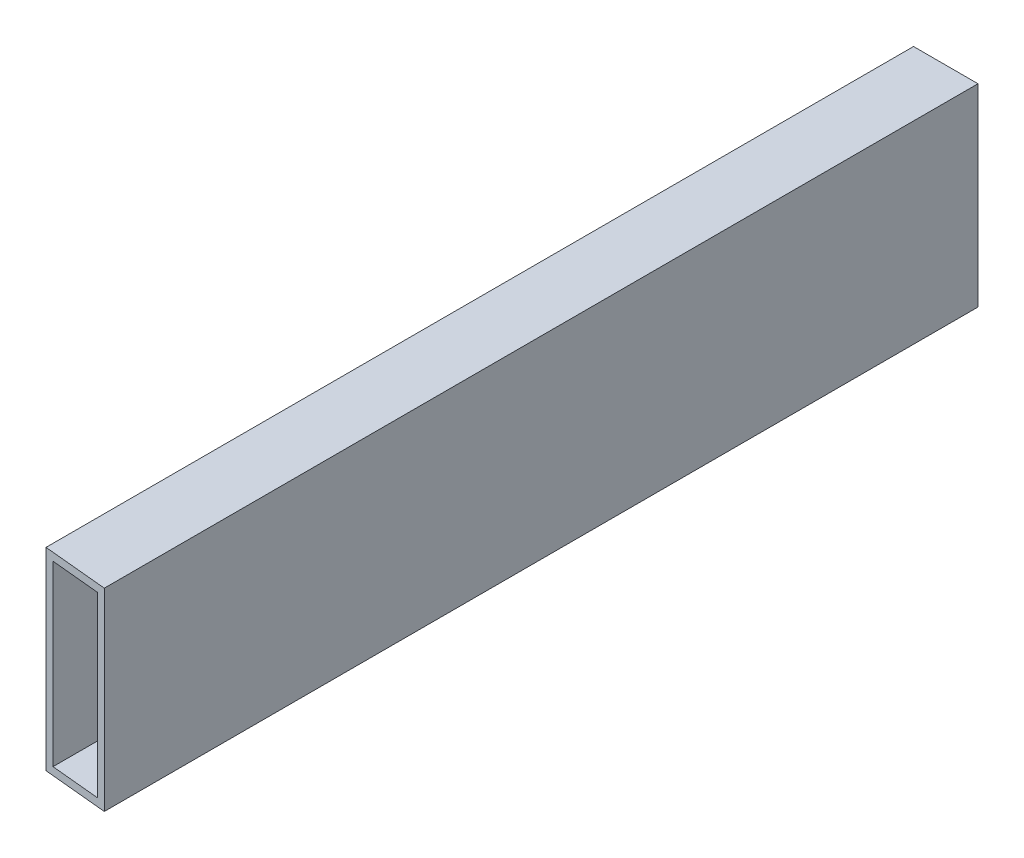
ISO-10303-21;
HEADER;
FILE_DESCRIPTION(('STEP AP214'),'2;1');
FILE_NAME('part.step','',(''),(''),'','','');
FILE_SCHEMA(('AUTOMOTIVE_DESIGN { 1 0 10303 214 1 1 1 1 }'));
ENDSEC;
DATA;
#1=APPLICATION_CONTEXT('core data for automotive mechanical design processes');
#2=APPLICATION_PROTOCOL_DEFINITION('international standard','automotive_design',2000,#1);
#3=PRODUCT_CONTEXT('',#1,'mechanical');
#4=PRODUCT('Part','Part','',(#3));
#5=PRODUCT_RELATED_PRODUCT_CATEGORY('part','',(#4));
#6=PRODUCT_DEFINITION_FORMATION('','',#4);
#7=PRODUCT_DEFINITION_CONTEXT('part definition',#1,'design');
#8=PRODUCT_DEFINITION('design','',#6,#7);
#9=PRODUCT_DEFINITION_SHAPE('','',#8);
#10=(LENGTH_UNIT() NAMED_UNIT(*) SI_UNIT(.MILLI.,.METRE.));
#11=(NAMED_UNIT(*) PLANE_ANGLE_UNIT() SI_UNIT($,.RADIAN.));
#12=(NAMED_UNIT(*) SI_UNIT($,.STERADIAN.) SOLID_ANGLE_UNIT());
#13=UNCERTAINTY_MEASURE_WITH_UNIT(LENGTH_MEASURE(1.E-05),#10,'distance_accuracy_value','');
#14=(GEOMETRIC_REPRESENTATION_CONTEXT(3) GLOBAL_UNCERTAINTY_ASSIGNED_CONTEXT((#13)) GLOBAL_UNIT_ASSIGNED_CONTEXT((#10,
#11,#12)) REPRESENTATION_CONTEXT('',''));
#15=CARTESIAN_POINT('',(0.,0.,0.));
#16=DIRECTION('',(0.,0.,1.));
#17=DIRECTION('',(1.,0.,0.));
#18=AXIS2_PLACEMENT_3D('',#15,#16,#17);
#19=CARTESIAN_POINT('',(12.7000000000001,0.,343.));
#20=DIRECTION('',(-1.,0.,0.));
#21=DIRECTION('',(0.,-1.,0.));
#22=AXIS2_PLACEMENT_3D('',#19,#20,#21);
#23=PLANE('',#22);
#24=DIRECTION('',(0.,0.,-1.));
#25=VECTOR('',#24,1.);
#26=CARTESIAN_POINT('',(12.7,38.1,343.));
#27=LINE('',#26,#25);
#28=CARTESIAN_POINT('',(12.7,38.1,344.217788135193));
#29=VERTEX_POINT('',#28);
#30=CARTESIAN_POINT('',(12.7,38.1,0.));
#31=VERTEX_POINT('',#30);
#32=EDGE_CURVE('E11',#29,#31,#27,.T.);
#33=ORIENTED_EDGE('',*,*,#32,.F.);
#34=DIRECTION('',(0.,-1.,0.));
#35=VECTOR('',#34,1.);
#36=CARTESIAN_POINT('',(12.7000000000001,0.,344.217788135193));
#37=LINE('',#36,#35);
#38=CARTESIAN_POINT('',(12.7,-38.1,344.217788135193));
#39=VERTEX_POINT('',#38);
#40=EDGE_CURVE('E100',#29,#39,#37,.T.);
#41=ORIENTED_EDGE('',*,*,#40,.T.);
#42=DIRECTION('',(0.,0.,-1.));
#43=VECTOR('',#42,1.);
#44=CARTESIAN_POINT('',(12.7,-38.1,343.));
#45=LINE('',#44,#43);
#46=CARTESIAN_POINT('',(12.7,-38.1,0.));
#47=VERTEX_POINT('',#46);
#48=EDGE_CURVE('E110',#39,#47,#45,.T.);
#49=ORIENTED_EDGE('',*,*,#48,.T.);
#50=DIRECTION('',(0.,1.,0.));
#51=VECTOR('',#50,1.);
#52=CARTESIAN_POINT('',(12.7000000000001,0.,0.));
#53=LINE('',#52,#51);
#54=EDGE_CURVE('E154',#47,#31,#53,.T.);
#55=ORIENTED_EDGE('',*,*,#54,.T.);
#56=EDGE_LOOP('',(#33,#41,#49,#55));
#57=FACE_BOUND('',#56,.T.);
#58=ADVANCED_FACE('F34',(#57),#23,.F.);
#59=CARTESIAN_POINT('',(0.,38.1,343.));
#60=DIRECTION('',(0.,1.,0.));
#61=DIRECTION('',(0.,0.,1.));
#62=AXIS2_PLACEMENT_3D('',#59,#60,#61);
#63=PLANE('',#62);
#64=DIRECTION('',(-0.995434128422968,0.,-0.0954510134613932));
#65=VECTOR('',#64,1.);
#66=CARTESIAN_POINT('',(0.,38.1,343.));
#67=LINE('',#66,#65);
#68=CARTESIAN_POINT('',(-12.7,38.1,341.782211864807));
#69=VERTEX_POINT('',#68);
#70=EDGE_CURVE('E113',#29,#69,#67,.T.);
#71=ORIENTED_EDGE('',*,*,#70,.F.);
#72=ORIENTED_EDGE('',*,*,#32,.T.);
#73=DIRECTION('',(1.,0.,0.));
#74=VECTOR('',#73,1.);
#75=CARTESIAN_POINT('',(0.,38.1,0.));
#76=LINE('',#75,#74);
#77=CARTESIAN_POINT('',(-12.7,38.1,0.));
#78=VERTEX_POINT('',#77);
#79=EDGE_CURVE('E159',#78,#31,#76,.T.);
#80=ORIENTED_EDGE('',*,*,#79,.F.);
#81=DIRECTION('',(0.,0.,-1.));
#82=VECTOR('',#81,1.);
#83=CARTESIAN_POINT('',(-12.7,38.1,343.));
#84=LINE('',#83,#82);
#85=EDGE_CURVE('E43',#69,#78,#84,.T.);
#86=ORIENTED_EDGE('',*,*,#85,.F.);
#87=EDGE_LOOP('',(#71,#72,#80,#86));
#88=FACE_BOUND('',#87,.T.);
#89=ADVANCED_FACE('F167',(#88),#63,.T.);
#90=CARTESIAN_POINT('',(-12.7,0.,343.));
#91=DIRECTION('',(-1.,0.,0.));
#92=DIRECTION('',(0.,0.,1.));
#93=AXIS2_PLACEMENT_3D('',#90,#91,#92);
#94=PLANE('',#93);
#95=DIRECTION('',(0.,-1.,0.));
#96=VECTOR('',#95,1.);
#97=CARTESIAN_POINT('',(-12.7,0.,341.782211864807));
#98=LINE('',#97,#96);
#99=CARTESIAN_POINT('',(-12.7,-38.1,341.782211864807));
#100=VERTEX_POINT('',#99);
#101=EDGE_CURVE('E59',#69,#100,#98,.T.);
#102=ORIENTED_EDGE('',*,*,#101,.F.);
#103=ORIENTED_EDGE('',*,*,#85,.T.);
#104=DIRECTION('',(0.,1.,0.));
#105=VECTOR('',#104,1.);
#106=CARTESIAN_POINT('',(-12.7,0.,0.));
#107=LINE('',#106,#105);
#108=CARTESIAN_POINT('',(-12.7,-38.1,0.));
#109=VERTEX_POINT('',#108);
#110=EDGE_CURVE('E161',#109,#78,#107,.T.);
#111=ORIENTED_EDGE('',*,*,#110,.F.);
#112=DIRECTION('',(0.,0.,-1.));
#113=VECTOR('',#112,1.);
#114=CARTESIAN_POINT('',(-12.7,-38.1,343.));
#115=LINE('',#114,#113);
#116=EDGE_CURVE('E119',#100,#109,#115,.T.);
#117=ORIENTED_EDGE('',*,*,#116,.F.);
#118=EDGE_LOOP('',(#102,#103,#111,#117));
#119=FACE_BOUND('',#118,.T.);
#120=ADVANCED_FACE('F192',(#119),#94,.T.);
#121=CARTESIAN_POINT('',(9.652,0.,343.));
#122=DIRECTION('',(1.,0.,0.));
#123=DIRECTION('',(0.,1.,0.));
#124=AXIS2_PLACEMENT_3D('',#121,#122,#123);
#125=PLANE('',#124);
#126=DIRECTION('',(0.,0.,-1.));
#127=VECTOR('',#126,1.);
#128=CARTESIAN_POINT('',(9.652,-35.052,343.));
#129=LINE('',#128,#127);
#130=CARTESIAN_POINT('',(9.652,-35.052,343.925518982747));
#131=VERTEX_POINT('',#130);
#132=CARTESIAN_POINT('',(9.652,-35.052,0.));
#133=VERTEX_POINT('',#132);
#134=EDGE_CURVE('E38',#131,#133,#129,.T.);
#135=ORIENTED_EDGE('',*,*,#134,.F.);
#136=DIRECTION('',(0.,1.,0.));
#137=VECTOR('',#136,1.);
#138=CARTESIAN_POINT('',(9.652,0.,343.925518982747));
#139=LINE('',#138,#137);
#140=CARTESIAN_POINT('',(9.652,35.052,343.925518982747));
#141=VERTEX_POINT('',#140);
#142=EDGE_CURVE('E169',#131,#141,#139,.T.);
#143=ORIENTED_EDGE('',*,*,#142,.T.);
#144=DIRECTION('',(0.,0.,-1.));
#145=VECTOR('',#144,1.);
#146=CARTESIAN_POINT('',(9.65199999999999,35.052,343.));
#147=LINE('',#146,#145);
#148=CARTESIAN_POINT('',(9.65199999999999,35.052,0.));
#149=VERTEX_POINT('',#148);
#150=EDGE_CURVE('E127',#141,#149,#147,.T.);
#151=ORIENTED_EDGE('',*,*,#150,.T.);
#152=DIRECTION('',(0.,-1.,0.));
#153=VECTOR('',#152,1.);
#154=CARTESIAN_POINT('',(9.652,0.,0.));
#155=LINE('',#154,#153);
#156=EDGE_CURVE('E112',#149,#133,#155,.T.);
#157=ORIENTED_EDGE('',*,*,#156,.T.);
#158=EDGE_LOOP('',(#135,#143,#151,#157));
#159=FACE_BOUND('',#158,.T.);
#160=ADVANCED_FACE('F36',(#159),#125,.F.);
#161=CARTESIAN_POINT('',(0.,-35.052,343.));
#162=DIRECTION('',(0.,1.,0.));
#163=DIRECTION('',(-1.,0.,0.));
#164=AXIS2_PLACEMENT_3D('',#161,#162,#163);
#165=PLANE('',#164);
#166=DIRECTION('',(-0.995434128422968,0.,-0.0954510134613932));
#167=VECTOR('',#166,1.);
#168=CARTESIAN_POINT('',(0.,-35.052,343.));
#169=LINE('',#168,#167);
#170=CARTESIAN_POINT('',(-9.65199999999999,-35.052,342.074481017253));
#171=VERTEX_POINT('',#170);
#172=EDGE_CURVE('E178',#131,#171,#169,.T.);
#173=ORIENTED_EDGE('',*,*,#172,.F.);
#174=ORIENTED_EDGE('',*,*,#134,.T.);
#175=DIRECTION('',(1.,0.,0.));
#176=VECTOR('',#175,1.);
#177=CARTESIAN_POINT('',(0.,-35.052,0.));
#178=LINE('',#177,#176);
#179=CARTESIAN_POINT('',(-9.65199999999999,-35.052,0.));
#180=VERTEX_POINT('',#179);
#181=EDGE_CURVE('E141',#180,#133,#178,.T.);
#182=ORIENTED_EDGE('',*,*,#181,.F.);
#183=DIRECTION('',(0.,0.,-1.));
#184=VECTOR('',#183,1.);
#185=CARTESIAN_POINT('',(-9.65199999999999,-35.052,343.));
#186=LINE('',#185,#184);
#187=EDGE_CURVE('E122',#171,#180,#186,.T.);
#188=ORIENTED_EDGE('',*,*,#187,.F.);
#189=EDGE_LOOP('',(#173,#174,#182,#188));
#190=FACE_BOUND('',#189,.T.);
#191=ADVANCED_FACE('F142',(#190),#165,.T.);
#192=CARTESIAN_POINT('',(-9.65199999999999,0.,343.));
#193=DIRECTION('',(1.,0.,0.));
#194=DIRECTION('',(0.,1.,0.));
#195=AXIS2_PLACEMENT_3D('',#192,#193,#194);
#196=PLANE('',#195);
#197=DIRECTION('',(0.,1.,0.));
#198=VECTOR('',#197,1.);
#199=CARTESIAN_POINT('',(-9.65199999999999,0.,342.074481017253));
#200=LINE('',#199,#198);
#201=CARTESIAN_POINT('',(-9.65199999999999,35.052,342.074481017253));
#202=VERTEX_POINT('',#201);
#203=EDGE_CURVE('E51',#171,#202,#200,.T.);
#204=ORIENTED_EDGE('',*,*,#203,.F.);
#205=ORIENTED_EDGE('',*,*,#187,.T.);
#206=DIRECTION('',(0.,-1.,0.));
#207=VECTOR('',#206,1.);
#208=CARTESIAN_POINT('',(-9.65199999999999,0.,0.));
#209=LINE('',#208,#207);
#210=CARTESIAN_POINT('',(-9.65199999999999,35.052,0.));
#211=VERTEX_POINT('',#210);
#212=EDGE_CURVE('E137',#211,#180,#209,.T.);
#213=ORIENTED_EDGE('',*,*,#212,.F.);
#214=DIRECTION('',(0.,0.,-1.));
#215=VECTOR('',#214,1.);
#216=CARTESIAN_POINT('',(-9.65199999999999,35.052,343.));
#217=LINE('',#216,#215);
#218=EDGE_CURVE('E129',#202,#211,#217,.T.);
#219=ORIENTED_EDGE('',*,*,#218,.F.);
#220=EDGE_LOOP('',(#204,#205,#213,#219));
#221=FACE_BOUND('',#220,.T.);
#222=ADVANCED_FACE('F134',(#221),#196,.T.);
#223=CARTESIAN_POINT('',(0.,35.052,343.));
#224=DIRECTION('',(0.,1.,0.));
#225=DIRECTION('',(0.,0.,1.));
#226=AXIS2_PLACEMENT_3D('',#223,#224,#225);
#227=PLANE('',#226);
#228=ORIENTED_EDGE('',*,*,#150,.F.);
#229=DIRECTION('',(-0.995434128422968,0.,-0.0954510134613932));
#230=VECTOR('',#229,1.);
#231=CARTESIAN_POINT('',(0.,35.052,343.));
#232=LINE('',#231,#230);
#233=EDGE_CURVE('E105',#141,#202,#232,.T.);
#234=ORIENTED_EDGE('',*,*,#233,.T.);
#235=ORIENTED_EDGE('',*,*,#218,.T.);
#236=DIRECTION('',(1.,0.,0.));
#237=VECTOR('',#236,1.);
#238=CARTESIAN_POINT('',(0.,35.052,0.));
#239=LINE('',#238,#237);
#240=EDGE_CURVE('E152',#211,#149,#239,.T.);
#241=ORIENTED_EDGE('',*,*,#240,.T.);
#242=EDGE_LOOP('',(#228,#234,#235,#241));
#243=FACE_BOUND('',#242,.T.);
#244=ADVANCED_FACE('F176',(#243),#227,.F.);
#245=CARTESIAN_POINT('',(0.,-38.1,343.));
#246=DIRECTION('',(0.,-1.,0.));
#247=DIRECTION('',(0.,0.,-1.));
#248=AXIS2_PLACEMENT_3D('',#245,#246,#247);
#249=PLANE('',#248);
#250=DIRECTION('',(-0.995434128422968,0.,-0.0954510134613932));
#251=VECTOR('',#250,1.);
#252=CARTESIAN_POINT('',(-32.5902123624666,-38.1,339.874962682013));
#253=LINE('',#252,#251);
#254=EDGE_CURVE('E97',#39,#100,#253,.T.);
#255=ORIENTED_EDGE('',*,*,#254,.T.);
#256=ORIENTED_EDGE('',*,*,#116,.T.);
#257=DIRECTION('',(-1.,0.,0.));
#258=VECTOR('',#257,1.);
#259=CARTESIAN_POINT('',(0.,-38.1,0.));
#260=LINE('',#259,#258);
#261=EDGE_CURVE('E118',#47,#109,#260,.T.);
#262=ORIENTED_EDGE('',*,*,#261,.F.);
#263=ORIENTED_EDGE('',*,*,#48,.F.);
#264=EDGE_LOOP('',(#255,#256,#262,#263));
#265=FACE_BOUND('',#264,.T.);
#266=ADVANCED_FACE('F116',(#265),#249,.T.);
#267=CARTESIAN_POINT('',(0.,0.,0.));
#268=DIRECTION('',(0.,0.,1.));
#269=DIRECTION('',(1.,0.,0.));
#270=AXIS2_PLACEMENT_3D('',#267,#268,#269);
#271=PLANE('',#270);
#272=ORIENTED_EDGE('',*,*,#156,.F.);
#273=ORIENTED_EDGE('',*,*,#240,.F.);
#274=ORIENTED_EDGE('',*,*,#212,.T.);
#275=ORIENTED_EDGE('',*,*,#181,.T.);
#276=EDGE_LOOP('',(#272,#273,#274,#275));
#277=FACE_BOUND('',#276,.T.);
#278=ORIENTED_EDGE('',*,*,#54,.F.);
#279=ORIENTED_EDGE('',*,*,#261,.T.);
#280=ORIENTED_EDGE('',*,*,#110,.T.);
#281=ORIENTED_EDGE('',*,*,#79,.T.);
#282=EDGE_LOOP('',(#278,#279,#280,#281));
#283=FACE_BOUND('',#282,.T.);
#284=ADVANCED_FACE('F149',(#277,#283),#271,.F.);
#285=CARTESIAN_POINT('',(-32.5902123624666,-38.1,339.874962682013));
#286=DIRECTION('',(0.0954510134613932,0.,-0.995434128422968));
#287=DIRECTION('',(-0.995434128422968,0.,-0.0954510134613932));
#288=AXIS2_PLACEMENT_3D('',#285,#286,#287);
#289=PLANE('',#288);
#290=ORIENTED_EDGE('',*,*,#172,.T.);
#291=ORIENTED_EDGE('',*,*,#203,.T.);
#292=ORIENTED_EDGE('',*,*,#233,.F.);
#293=ORIENTED_EDGE('',*,*,#142,.F.);
#294=EDGE_LOOP('',(#290,#291,#292,#293));
#295=FACE_BOUND('',#294,.T.);
#296=ORIENTED_EDGE('',*,*,#70,.T.);
#297=ORIENTED_EDGE('',*,*,#101,.T.);
#298=ORIENTED_EDGE('',*,*,#254,.F.);
#299=ORIENTED_EDGE('',*,*,#40,.F.);
#300=EDGE_LOOP('',(#296,#297,#298,#299));
#301=FACE_BOUND('',#300,.T.);
#302=ADVANCED_FACE('F99',(#295,#301),#289,.F.);
#303=CLOSED_SHELL('',(#58,#89,#120,#160,#191,#222,#244,#266,#284,#302));
#304=MANIFOLD_SOLID_BREP('B2',#303);
#305=ADVANCED_BREP_SHAPE_REPRESENTATION('',(#18,#304),#14);
#306=SHAPE_DEFINITION_REPRESENTATION(#9,#305);
ENDSEC;
END-ISO-10303-21;
